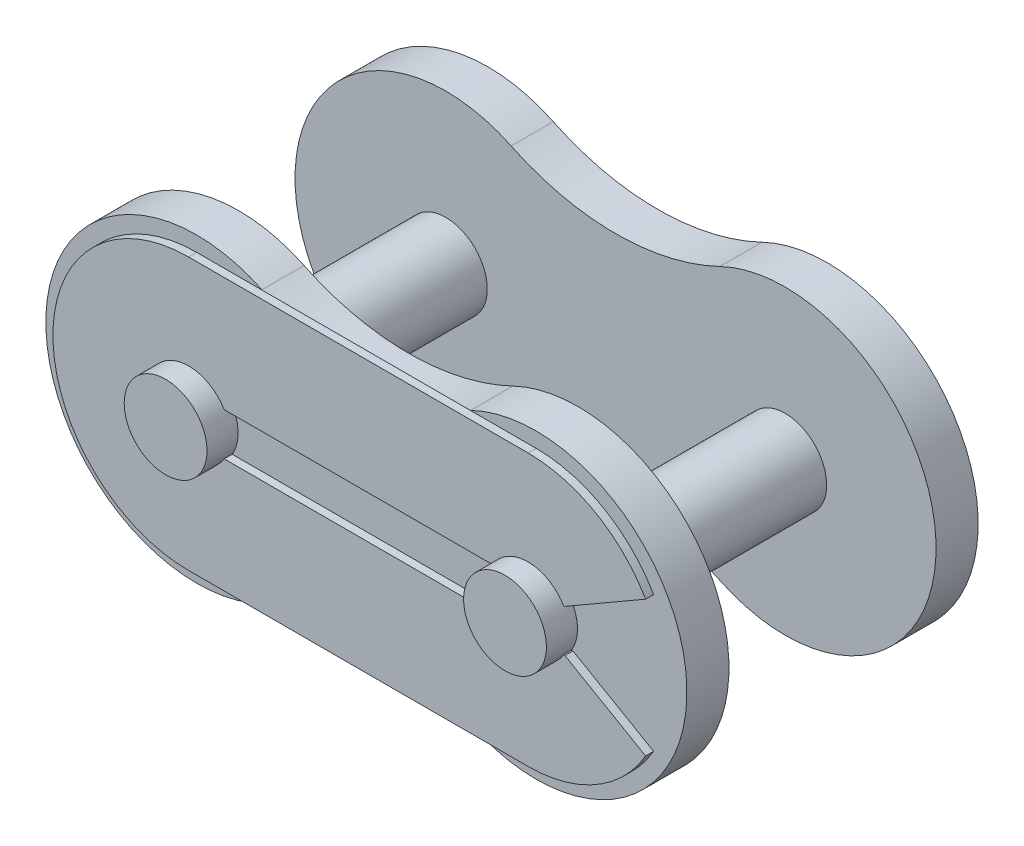
ISO-10303-21;
HEADER;
FILE_DESCRIPTION(('STEP AP214'),'2;1');
FILE_NAME('part.step','',(''),(''),'','','');
FILE_SCHEMA(('AUTOMOTIVE_DESIGN { 1 0 10303 214 1 1 1 1 }'));
ENDSEC;
DATA;
#1=APPLICATION_CONTEXT('core data for automotive mechanical design processes');
#2=APPLICATION_PROTOCOL_DEFINITION('international standard','automotive_design',2000,#1);
#3=PRODUCT_CONTEXT('',#1,'mechanical');
#4=PRODUCT('Part','Part','',(#3));
#5=PRODUCT_RELATED_PRODUCT_CATEGORY('part','',(#4));
#6=PRODUCT_DEFINITION_FORMATION('','',#4);
#7=PRODUCT_DEFINITION_CONTEXT('part definition',#1,'design');
#8=PRODUCT_DEFINITION('design','',#6,#7);
#9=PRODUCT_DEFINITION_SHAPE('','',#8);
#10=(LENGTH_UNIT() NAMED_UNIT(*) SI_UNIT(.MILLI.,.METRE.));
#11=(NAMED_UNIT(*) PLANE_ANGLE_UNIT() SI_UNIT($,.RADIAN.));
#12=(NAMED_UNIT(*) SI_UNIT($,.STERADIAN.) SOLID_ANGLE_UNIT());
#13=UNCERTAINTY_MEASURE_WITH_UNIT(LENGTH_MEASURE(1.E-05),#10,'distance_accuracy_value','');
#14=(GEOMETRIC_REPRESENTATION_CONTEXT(3) GLOBAL_UNCERTAINTY_ASSIGNED_CONTEXT((#13)) GLOBAL_UNIT_ASSIGNED_CONTEXT((#10,
#11,#12)) REPRESENTATION_CONTEXT('',''));
#15=CARTESIAN_POINT('',(0.,0.,0.));
#16=DIRECTION('',(0.,0.,1.));
#17=DIRECTION('',(1.,0.,0.));
#18=AXIS2_PLACEMENT_3D('',#15,#16,#17);
#19=CARTESIAN_POINT('',(0.,0.,6.6125));
#20=DIRECTION('',(0.,0.,1.));
#21=DIRECTION('',(1.,0.,0.));
#22=AXIS2_PLACEMENT_3D('',#19,#20,#21);
#23=PLANE('',#22);
#24=CARTESIAN_POINT('',(12.7,0.,6.6125));
#25=DIRECTION('',(0.,0.,-1.));
#26=DIRECTION('',(-1.,0.,0.));
#27=AXIS2_PLACEMENT_3D('',#24,#25,#26);
#28=CIRCLE('',#27,1.55);
#29=CARTESIAN_POINT('',(11.15,0.,6.6125));
#30=VERTEX_POINT('',#29);
#31=EDGE_CURVE('E19',#30,#30,#28,.T.);
#32=ORIENTED_EDGE('',*,*,#31,.F.);
#33=EDGE_LOOP('',(#32));
#34=FACE_BOUND('',#33,.T.);
#35=ADVANCED_FACE('F15',(#34),#23,.T.);
#36=CARTESIAN_POINT('',(0.,0.,6.6125));
#37=DIRECTION('',(0.,0.,1.));
#38=DIRECTION('',(1.,0.,0.));
#39=AXIS2_PLACEMENT_3D('',#36,#37,#38);
#40=PLANE('',#39);
#41=CARTESIAN_POINT('',(0.,0.,6.6125));
#42=DIRECTION('',(0.,0.,-1.));
#43=DIRECTION('',(-1.,0.,0.));
#44=AXIS2_PLACEMENT_3D('',#41,#42,#43);
#45=CIRCLE('',#44,1.55);
#46=CARTESIAN_POINT('',(-1.55,0.,6.6125));
#47=VERTEX_POINT('',#46);
#48=EDGE_CURVE('E189',#47,#47,#45,.T.);
#49=ORIENTED_EDGE('',*,*,#48,.F.);
#50=EDGE_LOOP('',(#49));
#51=FACE_BOUND('',#50,.T.);
#52=ADVANCED_FACE('F804',(#51),#40,.T.);
#53=CARTESIAN_POINT('',(0.,0.,5.45));
#54=DIRECTION('',(0.,0.,1.));
#55=DIRECTION('',(1.,0.,0.));
#56=AXIS2_PLACEMENT_3D('',#53,#54,#55);
#57=PLANE('',#56);
#58=CARTESIAN_POINT('',(12.7,0.,5.45));
#59=DIRECTION('',(0.,0.,-1.));
#60=DIRECTION('',(-1.,0.,0.));
#61=AXIS2_PLACEMENT_3D('',#58,#59,#60);
#62=CIRCLE('',#61,1.55);
#63=CARTESIAN_POINT('',(11.3710549531677,0.79775,5.45));
#64=VERTEX_POINT('',#63);
#65=CARTESIAN_POINT('',(11.3710549531677,-0.79775,5.45));
#66=VERTEX_POINT('',#65);
#67=EDGE_CURVE('E168',#64,#66,#62,.F.);
#68=ORIENTED_EDGE('',*,*,#67,.F.);
#69=DIRECTION('',(1.,0.,0.));
#70=VECTOR('',#69,1.);
#71=CARTESIAN_POINT('',(14.0817435317381,0.79775,5.45));
#72=LINE('',#71,#70);
#73=CARTESIAN_POINT('',(1.32894504683226,0.79775,5.45));
#74=VERTEX_POINT('',#73);
#75=EDGE_CURVE('E172',#74,#64,#72,.T.);
#76=ORIENTED_EDGE('',*,*,#75,.F.);
#77=CARTESIAN_POINT('',(0.,0.,5.45));
#78=DIRECTION('',(0.,0.,-1.));
#79=DIRECTION('',(-1.,0.,0.));
#80=AXIS2_PLACEMENT_3D('',#77,#78,#79);
#81=CIRCLE('',#80,1.55);
#82=CARTESIAN_POINT('',(1.32894504683226,-0.79775,5.45));
#83=VERTEX_POINT('',#82);
#84=EDGE_CURVE('E320',#83,#74,#81,.F.);
#85=ORIENTED_EDGE('',*,*,#84,.F.);
#86=DIRECTION('',(1.,0.,0.));
#87=VECTOR('',#86,1.);
#88=CARTESIAN_POINT('',(0.,-0.79775,5.45));
#89=LINE('',#88,#87);
#90=EDGE_CURVE('E175',#66,#83,#89,.F.);
#91=ORIENTED_EDGE('',*,*,#90,.F.);
#92=EDGE_LOOP('',(#68,#76,#85,#91));
#93=FACE_BOUND('',#92,.T.);
#94=ADVANCED_FACE('F170',(#93),#57,.T.);
#95=CARTESIAN_POINT('',(12.7,0.,6.6125));
#96=DIRECTION('',(0.,0.,-1.));
#97=DIRECTION('',(-1.,0.,0.));
#98=AXIS2_PLACEMENT_3D('',#95,#96,#97);
#99=CYLINDRICAL_SURFACE('',#98,1.55);
#100=ORIENTED_EDGE('',*,*,#31,.T.);
#101=EDGE_LOOP('',(#100));
#102=FACE_BOUND('',#101,.T.);
#103=DIRECTION('',(0.,0.,-1.));
#104=VECTOR('',#103,1.);
#105=CARTESIAN_POINT('',(14.0289450468323,-0.797749999999981,6.6125));
#106=LINE('',#105,#104);
#107=CARTESIAN_POINT('',(14.0289450468323,-0.797749999999991,5.75));
#108=VERTEX_POINT('',#107);
#109=CARTESIAN_POINT('',(14.0289450468323,-0.797749999999991,5.45));
#110=VERTEX_POINT('',#109);
#111=EDGE_CURVE('E178',#108,#110,#106,.T.);
#112=ORIENTED_EDGE('',*,*,#111,.T.);
#113=CARTESIAN_POINT('',(12.7,0.,5.45));
#114=DIRECTION('',(0.,0.,-1.));
#115=DIRECTION('',(-1.,0.,0.));
#116=AXIS2_PLACEMENT_3D('',#113,#114,#115);
#117=CIRCLE('',#116,1.55);
#118=CARTESIAN_POINT('',(14.0289450468323,0.797749999999991,5.45));
#119=VERTEX_POINT('',#118);
#120=EDGE_CURVE('E322',#110,#119,#117,.F.);
#121=ORIENTED_EDGE('',*,*,#120,.T.);
#122=DIRECTION('',(0.,0.,-1.));
#123=VECTOR('',#122,1.);
#124=CARTESIAN_POINT('',(14.0289450468323,0.797749999999982,6.6125));
#125=LINE('',#124,#123);
#126=CARTESIAN_POINT('',(14.0289450468323,0.797749999999991,5.75));
#127=VERTEX_POINT('',#126);
#128=EDGE_CURVE('E198',#119,#127,#125,.F.);
#129=ORIENTED_EDGE('',*,*,#128,.T.);
#130=CARTESIAN_POINT('',(12.7,0.,5.75));
#131=DIRECTION('',(0.,0.,-1.));
#132=DIRECTION('',(-1.,0.,0.));
#133=AXIS2_PLACEMENT_3D('',#130,#131,#132);
#134=CIRCLE('',#133,1.55);
#135=CARTESIAN_POINT('',(11.3710549531677,0.79775,5.75));
#136=VERTEX_POINT('',#135);
#137=EDGE_CURVE('E184',#136,#127,#134,.T.);
#138=ORIENTED_EDGE('',*,*,#137,.F.);
#139=DIRECTION('',(0.,0.,-1.));
#140=VECTOR('',#139,1.);
#141=CARTESIAN_POINT('',(11.3710549531677,0.79775,5.45));
#142=LINE('',#141,#140);
#143=EDGE_CURVE('E180',#64,#136,#142,.F.);
#144=ORIENTED_EDGE('',*,*,#143,.F.);
#145=ORIENTED_EDGE('',*,*,#67,.T.);
#146=DIRECTION('',(0.,0.,1.));
#147=VECTOR('',#146,1.);
#148=CARTESIAN_POINT('',(11.3710549531677,-0.79775,5.45));
#149=LINE('',#148,#147);
#150=CARTESIAN_POINT('',(11.3710549531677,-0.79775,5.75));
#151=VERTEX_POINT('',#150);
#152=EDGE_CURVE('E201',#151,#66,#149,.F.);
#153=ORIENTED_EDGE('',*,*,#152,.F.);
#154=CARTESIAN_POINT('',(12.7,0.,5.75));
#155=DIRECTION('',(0.,0.,-1.));
#156=DIRECTION('',(-1.,0.,0.));
#157=AXIS2_PLACEMENT_3D('',#154,#155,#156);
#158=CIRCLE('',#157,1.55);
#159=EDGE_CURVE('E193',#108,#151,#158,.T.);
#160=ORIENTED_EDGE('',*,*,#159,.F.);
#161=EDGE_LOOP('',(#112,#121,#129,#138,#144,#145,#153,#160));
#162=FACE_BOUND('',#161,.T.);
#163=ADVANCED_FACE('F182',(#102,#162),#99,.T.);
#164=CARTESIAN_POINT('',(0.,-0.79775,5.45));
#165=DIRECTION('',(0.,1.,0.));
#166=DIRECTION('',(0.,0.,1.));
#167=AXIS2_PLACEMENT_3D('',#164,#165,#166);
#168=PLANE('',#167);
#169=ORIENTED_EDGE('',*,*,#152,.T.);
#170=ORIENTED_EDGE('',*,*,#90,.T.);
#171=DIRECTION('',(0.,0.,-1.));
#172=VECTOR('',#171,1.);
#173=CARTESIAN_POINT('',(1.32894504683226,-0.79775,6.6125));
#174=LINE('',#173,#172);
#175=CARTESIAN_POINT('',(1.32894504683226,-0.79775,5.75));
#176=VERTEX_POINT('',#175);
#177=EDGE_CURVE('E200',#176,#83,#174,.T.);
#178=ORIENTED_EDGE('',*,*,#177,.F.);
#179=DIRECTION('',(1.,0.,0.));
#180=VECTOR('',#179,1.);
#181=CARTESIAN_POINT('',(0.,-0.79775,5.75));
#182=LINE('',#181,#180);
#183=EDGE_CURVE('E315',#151,#176,#182,.F.);
#184=ORIENTED_EDGE('',*,*,#183,.F.);
#185=EDGE_LOOP('',(#169,#170,#178,#184));
#186=FACE_BOUND('',#185,.T.);
#187=ADVANCED_FACE('F434',(#186),#168,.T.);
#188=CARTESIAN_POINT('',(0.,0.,6.6125));
#189=DIRECTION('',(0.,0.,-1.));
#190=DIRECTION('',(-1.,0.,0.));
#191=AXIS2_PLACEMENT_3D('',#188,#189,#190);
#192=CYLINDRICAL_SURFACE('',#191,1.55);
#193=ORIENTED_EDGE('',*,*,#177,.T.);
#194=ORIENTED_EDGE('',*,*,#84,.T.);
#195=DIRECTION('',(0.,0.,-1.));
#196=VECTOR('',#195,1.);
#197=CARTESIAN_POINT('',(1.32894504683226,0.79775,5.45));
#198=LINE('',#197,#196);
#199=CARTESIAN_POINT('',(1.32894504683226,0.79775,5.75));
#200=VERTEX_POINT('',#199);
#201=EDGE_CURVE('E188',#200,#74,#198,.T.);
#202=ORIENTED_EDGE('',*,*,#201,.F.);
#203=CARTESIAN_POINT('',(0.,0.,5.75));
#204=DIRECTION('',(0.,0.,-1.));
#205=DIRECTION('',(-1.,0.,0.));
#206=AXIS2_PLACEMENT_3D('',#203,#204,#205);
#207=CIRCLE('',#206,1.55);
#208=EDGE_CURVE('E311',#176,#200,#207,.T.);
#209=ORIENTED_EDGE('',*,*,#208,.F.);
#210=EDGE_LOOP('',(#193,#194,#202,#209));
#211=FACE_BOUND('',#210,.T.);
#212=ORIENTED_EDGE('',*,*,#48,.T.);
#213=EDGE_LOOP('',(#212));
#214=FACE_BOUND('',#213,.T.);
#215=ADVANCED_FACE('F431',(#211,#214),#192,.T.);
#216=CARTESIAN_POINT('',(14.0817435317381,0.79775,5.45));
#217=DIRECTION('',(0.,-1.,0.));
#218=DIRECTION('',(0.,0.,-1.));
#219=AXIS2_PLACEMENT_3D('',#216,#217,#218);
#220=PLANE('',#219);
#221=ORIENTED_EDGE('',*,*,#201,.T.);
#222=ORIENTED_EDGE('',*,*,#75,.T.);
#223=ORIENTED_EDGE('',*,*,#143,.T.);
#224=DIRECTION('',(1.,0.,0.));
#225=VECTOR('',#224,1.);
#226=CARTESIAN_POINT('',(0.,0.79775,5.75));
#227=LINE('',#226,#225);
#228=EDGE_CURVE('E314',#200,#136,#227,.T.);
#229=ORIENTED_EDGE('',*,*,#228,.F.);
#230=EDGE_LOOP('',(#221,#222,#223,#229));
#231=FACE_BOUND('',#230,.T.);
#232=ADVANCED_FACE('F191',(#231),#220,.T.);
#233=CARTESIAN_POINT('',(0.,0.,5.75));
#234=DIRECTION('',(0.,0.,1.));
#235=DIRECTION('',(1.,0.,0.));
#236=AXIS2_PLACEMENT_3D('',#233,#234,#235);
#237=PLANE('',#236);
#238=ORIENTED_EDGE('',*,*,#208,.T.);
#239=ORIENTED_EDGE('',*,*,#228,.T.);
#240=ORIENTED_EDGE('',*,*,#137,.T.);
#241=DIRECTION('',(1.,0.,0.));
#242=VECTOR('',#241,1.);
#243=CARTESIAN_POINT('',(14.0817435317381,0.79775,5.75));
#244=LINE('',#243,#242);
#245=CARTESIAN_POINT('',(14.0817435317381,0.797750000000007,5.75));
#246=VERTEX_POINT('',#245);
#247=EDGE_CURVE('E336',#246,#127,#244,.F.);
#248=ORIENTED_EDGE('',*,*,#247,.F.);
#249=DIRECTION('',(0.866025403784438,0.500000000000001,0.));
#250=VECTOR('',#249,1.);
#251=CARTESIAN_POINT('',(17.0994523524951,2.54002499999998,5.75));
#252=LINE('',#251,#250);
#253=CARTESIAN_POINT('',(17.0994523524951,2.54002499999999,5.75));
#254=VERTEX_POINT('',#253);
#255=EDGE_CURVE('E305',#254,#246,#252,.F.);
#256=ORIENTED_EDGE('',*,*,#255,.F.);
#257=CARTESIAN_POINT('',(12.7,0.,5.75));
#258=DIRECTION('',(0.,0.,1.));
#259=DIRECTION('',(1.,0.,0.));
#260=AXIS2_PLACEMENT_3D('',#257,#258,#259);
#261=CIRCLE('',#260,5.08005);
#262=CARTESIAN_POINT('',(12.7,5.08005,5.75));
#263=VERTEX_POINT('',#262);
#264=EDGE_CURVE('E302',#263,#254,#261,.F.);
#265=ORIENTED_EDGE('',*,*,#264,.F.);
#266=DIRECTION('',(1.,0.,0.));
#267=VECTOR('',#266,1.);
#268=CARTESIAN_POINT('',(0.,5.08005,5.75));
#269=LINE('',#268,#267);
#270=CARTESIAN_POINT('',(0.,5.08005,5.75));
#271=VERTEX_POINT('',#270);
#272=EDGE_CURVE('E350',#271,#263,#269,.T.);
#273=ORIENTED_EDGE('',*,*,#272,.F.);
#274=CARTESIAN_POINT('',(0.,0.,5.75));
#275=DIRECTION('',(0.,0.,1.));
#276=DIRECTION('',(1.,0.,0.));
#277=AXIS2_PLACEMENT_3D('',#274,#275,#276);
#278=CIRCLE('',#277,5.08005);
#279=CARTESIAN_POINT('',(0.,-5.08005,5.75));
#280=VERTEX_POINT('',#279);
#281=EDGE_CURVE('E297',#280,#271,#278,.F.);
#282=ORIENTED_EDGE('',*,*,#281,.F.);
#283=DIRECTION('',(1.,0.,0.));
#284=VECTOR('',#283,1.);
#285=CARTESIAN_POINT('',(12.7,-5.08005,5.75));
#286=LINE('',#285,#284);
#287=CARTESIAN_POINT('',(12.7,-5.08005,5.75));
#288=VERTEX_POINT('',#287);
#289=EDGE_CURVE('E355',#288,#280,#286,.F.);
#290=ORIENTED_EDGE('',*,*,#289,.F.);
#291=CARTESIAN_POINT('',(12.7,0.,5.75));
#292=DIRECTION('',(0.,0.,1.));
#293=DIRECTION('',(1.,0.,0.));
#294=AXIS2_PLACEMENT_3D('',#291,#292,#293);
#295=CIRCLE('',#294,5.08005);
#296=CARTESIAN_POINT('',(17.0994523524951,-2.540025,5.75));
#297=VERTEX_POINT('',#296);
#298=EDGE_CURVE('E307',#297,#288,#295,.F.);
#299=ORIENTED_EDGE('',*,*,#298,.F.);
#300=DIRECTION('',(-0.866025403784439,0.5,0.));
#301=VECTOR('',#300,1.);
#302=CARTESIAN_POINT('',(14.0817435317381,-0.79775,5.75));
#303=LINE('',#302,#301);
#304=CARTESIAN_POINT('',(14.0817435317381,-0.79775,5.75));
#305=VERTEX_POINT('',#304);
#306=EDGE_CURVE('E335',#305,#297,#303,.F.);
#307=ORIENTED_EDGE('',*,*,#306,.F.);
#308=DIRECTION('',(1.,0.,0.));
#309=VECTOR('',#308,1.);
#310=CARTESIAN_POINT('',(0.,-0.79775,5.75));
#311=LINE('',#310,#309);
#312=EDGE_CURVE('E332',#108,#305,#311,.T.);
#313=ORIENTED_EDGE('',*,*,#312,.F.);
#314=ORIENTED_EDGE('',*,*,#159,.T.);
#315=ORIENTED_EDGE('',*,*,#183,.T.);
#316=EDGE_LOOP('',(#238,#239,#240,#248,#256,#265,#273,#282,#290,#299,#307,#313,#314,#315));
#317=FACE_BOUND('',#316,.T.);
#318=ADVANCED_FACE('F426',(#317),#237,.T.);
#319=CARTESIAN_POINT('',(14.0817435317381,0.79775,5.45));
#320=DIRECTION('',(0.,-1.,0.));
#321=DIRECTION('',(0.,0.,-1.));
#322=AXIS2_PLACEMENT_3D('',#319,#320,#321);
#323=PLANE('',#322);
#324=DIRECTION('',(0.,0.,1.));
#325=VECTOR('',#324,1.);
#326=CARTESIAN_POINT('',(14.0817435317381,0.797750000000011,5.45));
#327=LINE('',#326,#325);
#328=CARTESIAN_POINT('',(14.0817435317381,0.797750000000004,5.45));
#329=VERTEX_POINT('',#328);
#330=EDGE_CURVE('E349',#246,#329,#327,.F.);
#331=ORIENTED_EDGE('',*,*,#330,.F.);
#332=ORIENTED_EDGE('',*,*,#247,.T.);
#333=ORIENTED_EDGE('',*,*,#128,.F.);
#334=DIRECTION('',(1.,0.,0.));
#335=VECTOR('',#334,1.);
#336=CARTESIAN_POINT('',(0.,0.79775,5.45));
#337=LINE('',#336,#335);
#338=EDGE_CURVE('E402',#329,#119,#337,.F.);
#339=ORIENTED_EDGE('',*,*,#338,.F.);
#340=EDGE_LOOP('',(#331,#332,#333,#339));
#341=FACE_BOUND('',#340,.T.);
#342=ADVANCED_FACE('F452',(#341),#323,.T.);
#343=CARTESIAN_POINT('',(0.,-0.79775,5.45));
#344=DIRECTION('',(0.,1.,0.));
#345=DIRECTION('',(0.,0.,1.));
#346=AXIS2_PLACEMENT_3D('',#343,#344,#345);
#347=PLANE('',#346);
#348=DIRECTION('',(0.,0.,1.));
#349=VECTOR('',#348,1.);
#350=CARTESIAN_POINT('',(14.0817435317381,-0.79775,5.45));
#351=LINE('',#350,#349);
#352=CARTESIAN_POINT('',(14.0817435317381,-0.797750000000002,5.45));
#353=VERTEX_POINT('',#352);
#354=EDGE_CURVE('E310',#353,#305,#351,.T.);
#355=ORIENTED_EDGE('',*,*,#354,.F.);
#356=DIRECTION('',(1.,0.,0.));
#357=VECTOR('',#356,1.);
#358=CARTESIAN_POINT('',(0.,-0.79775,5.45));
#359=LINE('',#358,#357);
#360=EDGE_CURVE('E405',#110,#353,#359,.T.);
#361=ORIENTED_EDGE('',*,*,#360,.F.);
#362=ORIENTED_EDGE('',*,*,#111,.F.);
#363=ORIENTED_EDGE('',*,*,#312,.T.);
#364=EDGE_LOOP('',(#355,#361,#362,#363));
#365=FACE_BOUND('',#364,.T.);
#366=ADVANCED_FACE('F439',(#365),#347,.T.);
#367=CARTESIAN_POINT('',(14.0817435317381,-0.79775,5.45));
#368=DIRECTION('',(0.5,0.866025403784439,0.));
#369=DIRECTION('',(-0.866025403784439,0.5,0.));
#370=AXIS2_PLACEMENT_3D('',#367,#368,#369);
#371=PLANE('',#370);
#372=DIRECTION('',(0.866025403784435,-0.500000000000006,0.));
#373=VECTOR('',#372,1.);
#374=CARTESIAN_POINT('',(14.0817435317381,-0.79775,5.45));
#375=LINE('',#374,#373);
#376=CARTESIAN_POINT('',(17.0994523524951,-2.54002500000001,5.45));
#377=VERTEX_POINT('',#376);
#378=EDGE_CURVE('E296',#353,#377,#375,.T.);
#379=ORIENTED_EDGE('',*,*,#378,.F.);
#380=ORIENTED_EDGE('',*,*,#354,.T.);
#381=ORIENTED_EDGE('',*,*,#306,.T.);
#382=DIRECTION('',(0.,0.,1.));
#383=VECTOR('',#382,1.);
#384=CARTESIAN_POINT('',(17.0994523524951,-2.54002500000001,5.45));
#385=LINE('',#384,#383);
#386=EDGE_CURVE('E306',#377,#297,#385,.T.);
#387=ORIENTED_EDGE('',*,*,#386,.F.);
#388=EDGE_LOOP('',(#379,#380,#381,#387));
#389=FACE_BOUND('',#388,.T.);
#390=ADVANCED_FACE('F443',(#389),#371,.T.);
#391=CARTESIAN_POINT('',(12.7,0.,5.45));
#392=DIRECTION('',(0.,0.,1.));
#393=DIRECTION('',(1.,0.,0.));
#394=AXIS2_PLACEMENT_3D('',#391,#392,#393);
#395=CYLINDRICAL_SURFACE('',#394,5.08005);
#396=CARTESIAN_POINT('',(12.7,0.,5.45));
#397=DIRECTION('',(0.,0.,1.));
#398=DIRECTION('',(1.,0.,0.));
#399=AXIS2_PLACEMENT_3D('',#396,#397,#398);
#400=CIRCLE('',#399,5.08005);
#401=CARTESIAN_POINT('',(12.7,-5.08005,5.45));
#402=VERTEX_POINT('',#401);
#403=EDGE_CURVE('E293',#377,#402,#400,.F.);
#404=ORIENTED_EDGE('',*,*,#403,.F.);
#405=ORIENTED_EDGE('',*,*,#386,.T.);
#406=ORIENTED_EDGE('',*,*,#298,.T.);
#407=DIRECTION('',(0.,0.,-1.));
#408=VECTOR('',#407,1.);
#409=CARTESIAN_POINT('',(12.7,-5.08005,5.45));
#410=LINE('',#409,#408);
#411=EDGE_CURVE('E301',#402,#288,#410,.F.);
#412=ORIENTED_EDGE('',*,*,#411,.F.);
#413=EDGE_LOOP('',(#404,#405,#406,#412));
#414=FACE_BOUND('',#413,.T.);
#415=ADVANCED_FACE('F731',(#414),#395,.T.);
#416=CARTESIAN_POINT('',(12.7,0.,5.45));
#417=DIRECTION('',(0.,0.,1.));
#418=DIRECTION('',(1.,0.,0.));
#419=AXIS2_PLACEMENT_3D('',#416,#417,#418);
#420=CYLINDRICAL_SURFACE('',#419,5.08005);
#421=CARTESIAN_POINT('',(12.7,0.,5.45));
#422=DIRECTION('',(0.,0.,1.));
#423=DIRECTION('',(1.,0.,0.));
#424=AXIS2_PLACEMENT_3D('',#421,#422,#423);
#425=CIRCLE('',#424,5.08005);
#426=CARTESIAN_POINT('',(12.7,5.08005,5.45));
#427=VERTEX_POINT('',#426);
#428=CARTESIAN_POINT('',(17.0994523524951,2.54002499999999,5.45));
#429=VERTEX_POINT('',#428);
#430=EDGE_CURVE('E284',#427,#429,#425,.F.);
#431=ORIENTED_EDGE('',*,*,#430,.F.);
#432=DIRECTION('',(0.,0.,1.));
#433=VECTOR('',#432,1.);
#434=CARTESIAN_POINT('',(12.7,5.08005,5.45));
#435=LINE('',#434,#433);
#436=EDGE_CURVE('E353',#263,#427,#435,.F.);
#437=ORIENTED_EDGE('',*,*,#436,.F.);
#438=ORIENTED_EDGE('',*,*,#264,.T.);
#439=DIRECTION('',(0.,0.,1.));
#440=VECTOR('',#439,1.);
#441=CARTESIAN_POINT('',(17.0994523524951,2.54002499999998,5.45));
#442=LINE('',#441,#440);
#443=EDGE_CURVE('E354',#429,#254,#442,.T.);
#444=ORIENTED_EDGE('',*,*,#443,.F.);
#445=EDGE_LOOP('',(#431,#437,#438,#444));
#446=FACE_BOUND('',#445,.T.);
#447=ADVANCED_FACE('F459',(#446),#420,.T.);
#448=CARTESIAN_POINT('',(17.0994523524951,2.54002499999998,5.45));
#449=DIRECTION('',(0.500000000000001,-0.866025403784438,0.));
#450=DIRECTION('',(0.866025403784438,0.500000000000001,0.));
#451=AXIS2_PLACEMENT_3D('',#448,#449,#450);
#452=PLANE('',#451);
#453=DIRECTION('',(-0.866025403784436,-0.500000000000004,0.));
#454=VECTOR('',#453,1.);
#455=CARTESIAN_POINT('',(17.0994523524951,2.54002499999998,5.45));
#456=LINE('',#455,#454);
#457=EDGE_CURVE('E287',#429,#329,#456,.T.);
#458=ORIENTED_EDGE('',*,*,#457,.F.);
#459=ORIENTED_EDGE('',*,*,#443,.T.);
#460=ORIENTED_EDGE('',*,*,#255,.T.);
#461=ORIENTED_EDGE('',*,*,#330,.T.);
#462=EDGE_LOOP('',(#458,#459,#460,#461));
#463=FACE_BOUND('',#462,.T.);
#464=ADVANCED_FACE('F455',(#463),#452,.T.);
#465=CARTESIAN_POINT('',(0.,5.08005,5.45));
#466=DIRECTION('',(0.,1.,0.));
#467=DIRECTION('',(0.,0.,1.));
#468=AXIS2_PLACEMENT_3D('',#465,#466,#467);
#469=PLANE('',#468);
#470=DIRECTION('',(1.,0.,0.));
#471=VECTOR('',#470,1.);
#472=CARTESIAN_POINT('',(0.,5.08005,5.45));
#473=LINE('',#472,#471);
#474=CARTESIAN_POINT('',(0.,5.08005,5.45));
#475=VERTEX_POINT('',#474);
#476=CARTESIAN_POINT('',(2.4605150527117,5.08005000000001,5.45));
#477=VERTEX_POINT('',#476);
#478=EDGE_CURVE('E393',#475,#477,#473,.T.);
#479=ORIENTED_EDGE('',*,*,#478,.F.);
#480=DIRECTION('',(0.,0.,1.));
#481=VECTOR('',#480,1.);
#482=CARTESIAN_POINT('',(0.,5.08005,5.45));
#483=LINE('',#482,#481);
#484=EDGE_CURVE('E300',#271,#475,#483,.F.);
#485=ORIENTED_EDGE('',*,*,#484,.F.);
#486=ORIENTED_EDGE('',*,*,#272,.T.);
#487=ORIENTED_EDGE('',*,*,#436,.T.);
#488=DIRECTION('',(1.,0.,0.));
#489=VECTOR('',#488,1.);
#490=CARTESIAN_POINT('',(0.,5.08005,5.45));
#491=LINE('',#490,#489);
#492=CARTESIAN_POINT('',(10.2394849472884,5.08005,5.45));
#493=VERTEX_POINT('',#492);
#494=EDGE_CURVE('E288',#493,#427,#491,.T.);
#495=ORIENTED_EDGE('',*,*,#494,.F.);
#496=DIRECTION('',(1.,0.,0.));
#497=VECTOR('',#496,1.);
#498=CARTESIAN_POINT('',(0.,5.08005,5.45));
#499=LINE('',#498,#497);
#500=EDGE_CURVE('E396',#493,#477,#499,.F.);
#501=ORIENTED_EDGE('',*,*,#500,.T.);
#502=EDGE_LOOP('',(#479,#485,#486,#487,#495,#501));
#503=FACE_BOUND('',#502,.T.);
#504=ADVANCED_FACE('F462',(#503),#469,.T.);
#505=CARTESIAN_POINT('',(12.7,-5.08005,5.45));
#506=DIRECTION('',(0.,-1.,0.));
#507=DIRECTION('',(0.,0.,-1.));
#508=AXIS2_PLACEMENT_3D('',#505,#506,#507);
#509=PLANE('',#508);
#510=DIRECTION('',(1.,0.,0.));
#511=VECTOR('',#510,1.);
#512=CARTESIAN_POINT('',(0.,-5.08005,5.45));
#513=LINE('',#512,#511);
#514=CARTESIAN_POINT('',(10.2394849472883,-5.08005,5.45));
#515=VERTEX_POINT('',#514);
#516=EDGE_CURVE('E292',#402,#515,#513,.F.);
#517=ORIENTED_EDGE('',*,*,#516,.F.);
#518=ORIENTED_EDGE('',*,*,#411,.T.);
#519=ORIENTED_EDGE('',*,*,#289,.T.);
#520=DIRECTION('',(0.,0.,1.));
#521=VECTOR('',#520,1.);
#522=CARTESIAN_POINT('',(0.,-5.08005,5.45));
#523=LINE('',#522,#521);
#524=CARTESIAN_POINT('',(0.,-5.08005,5.45));
#525=VERTEX_POINT('',#524);
#526=EDGE_CURVE('E373',#525,#280,#523,.T.);
#527=ORIENTED_EDGE('',*,*,#526,.F.);
#528=DIRECTION('',(1.,0.,0.));
#529=VECTOR('',#528,1.);
#530=CARTESIAN_POINT('',(0.,-5.08005,5.45));
#531=LINE('',#530,#529);
#532=CARTESIAN_POINT('',(2.46051505271168,-5.08005,5.45));
#533=VERTEX_POINT('',#532);
#534=EDGE_CURVE('E283',#533,#525,#531,.F.);
#535=ORIENTED_EDGE('',*,*,#534,.F.);
#536=DIRECTION('',(1.,0.,0.));
#537=VECTOR('',#536,1.);
#538=CARTESIAN_POINT('',(0.,-5.08005,5.45));
#539=LINE('',#538,#537);
#540=EDGE_CURVE('E376',#533,#515,#539,.T.);
#541=ORIENTED_EDGE('',*,*,#540,.T.);
#542=EDGE_LOOP('',(#517,#518,#519,#527,#535,#541));
#543=FACE_BOUND('',#542,.T.);
#544=ADVANCED_FACE('F466',(#543),#509,.T.);
#545=CARTESIAN_POINT('',(0.,0.,5.45));
#546=DIRECTION('',(0.,0.,1.));
#547=DIRECTION('',(1.,0.,0.));
#548=AXIS2_PLACEMENT_3D('',#545,#546,#547);
#549=CYLINDRICAL_SURFACE('',#548,5.08005);
#550=CARTESIAN_POINT('',(0.,0.,5.45));
#551=DIRECTION('',(0.,0.,1.));
#552=DIRECTION('',(1.,0.,0.));
#553=AXIS2_PLACEMENT_3D('',#550,#551,#552);
#554=CIRCLE('',#553,5.08005);
#555=EDGE_CURVE('E280',#525,#475,#554,.F.);
#556=ORIENTED_EDGE('',*,*,#555,.F.);
#557=ORIENTED_EDGE('',*,*,#526,.T.);
#558=ORIENTED_EDGE('',*,*,#281,.T.);
#559=ORIENTED_EDGE('',*,*,#484,.T.);
#560=EDGE_LOOP('',(#556,#557,#558,#559));
#561=FACE_BOUND('',#560,.T.);
#562=ADVANCED_FACE('F468',(#561),#549,.T.);
#563=CARTESIAN_POINT('',(0.,0.,-6.6125));
#564=DIRECTION('',(0.,0.,1.));
#565=DIRECTION('',(1.,0.,0.));
#566=AXIS2_PLACEMENT_3D('',#563,#564,#565);
#567=PLANE('',#566);
#568=CARTESIAN_POINT('',(12.7,0.,-6.6125));
#569=DIRECTION('',(0.,0.,-1.));
#570=DIRECTION('',(-1.,0.,0.));
#571=AXIS2_PLACEMENT_3D('',#568,#569,#570);
#572=CIRCLE('',#571,1.55);
#573=CARTESIAN_POINT('',(11.15,0.,-6.6125));
#574=VERTEX_POINT('',#573);
#575=EDGE_CURVE('E277',#574,#574,#572,.F.);
#576=ORIENTED_EDGE('',*,*,#575,.F.);
#577=EDGE_LOOP('',(#576));
#578=FACE_BOUND('',#577,.T.);
#579=ADVANCED_FACE('F686',(#578),#567,.F.);
#580=CARTESIAN_POINT('',(0.,0.,-6.6125));
#581=DIRECTION('',(0.,0.,1.));
#582=DIRECTION('',(1.,0.,0.));
#583=AXIS2_PLACEMENT_3D('',#580,#581,#582);
#584=PLANE('',#583);
#585=CARTESIAN_POINT('',(0.,0.,-6.6125));
#586=DIRECTION('',(0.,0.,-1.));
#587=DIRECTION('',(-1.,0.,0.));
#588=AXIS2_PLACEMENT_3D('',#585,#586,#587);
#589=CIRCLE('',#588,1.55);
#590=CARTESIAN_POINT('',(-1.55,0.,-6.6125));
#591=VERTEX_POINT('',#590);
#592=EDGE_CURVE('E274',#591,#591,#589,.F.);
#593=ORIENTED_EDGE('',*,*,#592,.F.);
#594=EDGE_LOOP('',(#593));
#595=FACE_BOUND('',#594,.T.);
#596=ADVANCED_FACE('F678',(#595),#584,.F.);
#597=CARTESIAN_POINT('',(0.,0.,5.45));
#598=DIRECTION('',(0.,0.,1.));
#599=DIRECTION('',(1.,0.,0.));
#600=AXIS2_PLACEMENT_3D('',#597,#598,#599);
#601=PLANE('',#600);
#602=ORIENTED_EDGE('',*,*,#540,.F.);
#603=CARTESIAN_POINT('',(6.35,-13.2307849536602,5.45));
#604=DIRECTION('',(0.,0.,1.));
#605=DIRECTION('',(1.,0.,0.));
#606=AXIS2_PLACEMENT_3D('',#603,#604,#605);
#607=CIRCLE('',#606,9.03120000000002);
#608=EDGE_CURVE('E268',#533,#515,#607,.F.);
#609=ORIENTED_EDGE('',*,*,#608,.T.);
#610=EDGE_LOOP('',(#602,#609));
#611=FACE_BOUND('',#610,.T.);
#612=ADVANCED_FACE('F475',(#611),#601,.F.);
#613=CARTESIAN_POINT('',(0.,0.,5.45));
#614=DIRECTION('',(0.,0.,1.));
#615=DIRECTION('',(1.,0.,0.));
#616=AXIS2_PLACEMENT_3D('',#613,#614,#615);
#617=PLANE('',#616);
#618=ORIENTED_EDGE('',*,*,#430,.T.);
#619=ORIENTED_EDGE('',*,*,#457,.T.);
#620=ORIENTED_EDGE('',*,*,#338,.T.);
#621=ORIENTED_EDGE('',*,*,#120,.F.);
#622=ORIENTED_EDGE('',*,*,#360,.T.);
#623=ORIENTED_EDGE('',*,*,#378,.T.);
#624=ORIENTED_EDGE('',*,*,#403,.T.);
#625=ORIENTED_EDGE('',*,*,#516,.T.);
#626=CARTESIAN_POINT('',(6.35,-13.2307849536602,5.45));
#627=DIRECTION('',(0.,0.,1.));
#628=DIRECTION('',(1.,0.,0.));
#629=AXIS2_PLACEMENT_3D('',#626,#627,#628);
#630=CIRCLE('',#629,9.03120000000002);
#631=CARTESIAN_POINT('',(10.2576923076923,-5.08876344371545,5.45));
#632=VERTEX_POINT('',#631);
#633=EDGE_CURVE('E266',#515,#632,#630,.F.);
#634=ORIENTED_EDGE('',*,*,#633,.T.);
#635=CARTESIAN_POINT('',(12.7,0.,5.45));
#636=DIRECTION('',(0.,0.,1.));
#637=DIRECTION('',(1.,0.,0.));
#638=AXIS2_PLACEMENT_3D('',#635,#636,#637);
#639=CIRCLE('',#638,5.6445);
#640=CARTESIAN_POINT('',(10.2576922418792,5.08876341212903,5.45));
#641=VERTEX_POINT('',#640);
#642=EDGE_CURVE('E262',#641,#632,#639,.F.);
#643=ORIENTED_EDGE('',*,*,#642,.F.);
#644=CARTESIAN_POINT('',(6.35000000000001,13.2307849536602,5.45));
#645=DIRECTION('',(0.,0.,1.));
#646=DIRECTION('',(1.,0.,0.));
#647=AXIS2_PLACEMENT_3D('',#644,#645,#646);
#648=CIRCLE('',#647,9.03120000000002);
#649=EDGE_CURVE('E289',#641,#493,#648,.F.);
#650=ORIENTED_EDGE('',*,*,#649,.T.);
#651=ORIENTED_EDGE('',*,*,#494,.T.);
#652=EDGE_LOOP('',(#618,#619,#620,#621,#622,#623,#624,#625,#634,#643,#650,#651));
#653=FACE_BOUND('',#652,.T.);
#654=ADVANCED_FACE('F447',(#653),#617,.T.);
#655=CARTESIAN_POINT('',(0.,0.,5.45));
#656=DIRECTION('',(0.,0.,1.));
#657=DIRECTION('',(1.,0.,0.));
#658=AXIS2_PLACEMENT_3D('',#655,#656,#657);
#659=PLANE('',#658);
#660=ORIENTED_EDGE('',*,*,#500,.F.);
#661=CARTESIAN_POINT('',(6.35000000000001,13.2307849536602,5.45));
#662=DIRECTION('',(0.,0.,1.));
#663=DIRECTION('',(1.,0.,0.));
#664=AXIS2_PLACEMENT_3D('',#661,#662,#663);
#665=CIRCLE('',#664,9.03120000000002);
#666=EDGE_CURVE('E258',#493,#477,#665,.F.);
#667=ORIENTED_EDGE('',*,*,#666,.T.);
#668=EDGE_LOOP('',(#660,#667));
#669=FACE_BOUND('',#668,.T.);
#670=ADVANCED_FACE('F494',(#669),#659,.F.);
#671=CARTESIAN_POINT('',(0.,0.,5.45));
#672=DIRECTION('',(0.,0.,1.));
#673=DIRECTION('',(1.,0.,0.));
#674=AXIS2_PLACEMENT_3D('',#671,#672,#673);
#675=PLANE('',#674);
#676=ORIENTED_EDGE('',*,*,#534,.T.);
#677=ORIENTED_EDGE('',*,*,#555,.T.);
#678=ORIENTED_EDGE('',*,*,#478,.T.);
#679=CARTESIAN_POINT('',(6.35000000000001,13.2307849536602,5.45));
#680=DIRECTION('',(0.,0.,1.));
#681=DIRECTION('',(1.,0.,0.));
#682=AXIS2_PLACEMENT_3D('',#679,#680,#681);
#683=CIRCLE('',#682,9.03120000000002);
#684=CARTESIAN_POINT('',(2.4423076923077,5.08876344371546,5.45));
#685=VERTEX_POINT('',#684);
#686=EDGE_CURVE('E256',#477,#685,#683,.F.);
#687=ORIENTED_EDGE('',*,*,#686,.T.);
#688=CARTESIAN_POINT('',(0.,0.,5.45));
#689=DIRECTION('',(0.,0.,1.));
#690=DIRECTION('',(1.,0.,0.));
#691=AXIS2_PLACEMENT_3D('',#688,#689,#690);
#692=CIRCLE('',#691,5.6445);
#693=CARTESIAN_POINT('',(2.44230775812081,-5.08876341212901,5.45));
#694=VERTEX_POINT('',#693);
#695=EDGE_CURVE('E252',#694,#685,#692,.F.);
#696=ORIENTED_EDGE('',*,*,#695,.F.);
#697=CARTESIAN_POINT('',(6.35,-13.2307849536602,5.45));
#698=DIRECTION('',(0.,0.,1.));
#699=DIRECTION('',(1.,0.,0.));
#700=AXIS2_PLACEMENT_3D('',#697,#698,#699);
#701=CIRCLE('',#700,9.03120000000002);
#702=EDGE_CURVE('E271',#694,#533,#701,.F.);
#703=ORIENTED_EDGE('',*,*,#702,.T.);
#704=EDGE_LOOP('',(#676,#677,#678,#687,#696,#703));
#705=FACE_BOUND('',#704,.T.);
#706=ADVANCED_FACE('F470',(#705),#675,.T.);
#707=CARTESIAN_POINT('',(12.7,0.,6.6125));
#708=DIRECTION('',(0.,0.,-1.));
#709=DIRECTION('',(-1.,0.,0.));
#710=AXIS2_PLACEMENT_3D('',#707,#708,#709);
#711=CYLINDRICAL_SURFACE('',#710,1.55);
#712=CARTESIAN_POINT('',(12.7,0.,-5.45));
#713=DIRECTION('',(0.,0.,-1.));
#714=DIRECTION('',(-1.,0.,0.));
#715=AXIS2_PLACEMENT_3D('',#712,#713,#714);
#716=CIRCLE('',#715,1.55);
#717=CARTESIAN_POINT('',(11.15,0.,-5.45));
#718=VERTEX_POINT('',#717);
#719=EDGE_CURVE('E248',#718,#718,#716,.T.);
#720=ORIENTED_EDGE('',*,*,#719,.T.);
#721=EDGE_LOOP('',(#720));
#722=FACE_BOUND('',#721,.T.);
#723=ORIENTED_EDGE('',*,*,#575,.T.);
#724=EDGE_LOOP('',(#723));
#725=FACE_BOUND('',#724,.T.);
#726=ADVANCED_FACE('F640',(#722,#725),#711,.T.);
#727=CARTESIAN_POINT('',(0.,0.,6.6125));
#728=DIRECTION('',(0.,0.,-1.));
#729=DIRECTION('',(-1.,0.,0.));
#730=AXIS2_PLACEMENT_3D('',#727,#728,#729);
#731=CYLINDRICAL_SURFACE('',#730,1.55);
#732=ORIENTED_EDGE('',*,*,#592,.T.);
#733=EDGE_LOOP('',(#732));
#734=FACE_BOUND('',#733,.T.);
#735=CARTESIAN_POINT('',(0.,0.,-5.45));
#736=DIRECTION('',(0.,0.,-1.));
#737=DIRECTION('',(-1.,0.,0.));
#738=AXIS2_PLACEMENT_3D('',#735,#736,#737);
#739=CIRCLE('',#738,1.55);
#740=CARTESIAN_POINT('',(-1.55,0.,-5.45));
#741=VERTEX_POINT('',#740);
#742=EDGE_CURVE('E245',#741,#741,#739,.T.);
#743=ORIENTED_EDGE('',*,*,#742,.T.);
#744=EDGE_LOOP('',(#743));
#745=FACE_BOUND('',#744,.T.);
#746=ADVANCED_FACE('F632',(#734,#745),#731,.T.);
#747=CARTESIAN_POINT('',(6.35,-13.2307849536602,3.875));
#748=DIRECTION('',(0.,0.,1.));
#749=DIRECTION('',(1.,0.,0.));
#750=AXIS2_PLACEMENT_3D('',#747,#748,#749);
#751=CYLINDRICAL_SURFACE('',#750,9.03120000000002);
#752=ORIENTED_EDGE('',*,*,#608,.F.);
#753=ORIENTED_EDGE('',*,*,#702,.F.);
#754=DIRECTION('',(0.,0.,1.));
#755=VECTOR('',#754,1.);
#756=CARTESIAN_POINT('',(2.44230782393394,-5.08876338054257,3.875));
#757=LINE('',#756,#755);
#758=CARTESIAN_POINT('',(2.44230775812081,-5.08876341212901,3.875));
#759=VERTEX_POINT('',#758);
#760=EDGE_CURVE('E251',#759,#694,#757,.T.);
#761=ORIENTED_EDGE('',*,*,#760,.F.);
#762=CARTESIAN_POINT('',(6.35,-13.2307849536602,3.875));
#763=DIRECTION('',(0.,0.,1.));
#764=DIRECTION('',(1.,0.,0.));
#765=AXIS2_PLACEMENT_3D('',#762,#763,#764);
#766=CIRCLE('',#765,9.03120000000002);
#767=CARTESIAN_POINT('',(10.2576923076923,-5.08876344371545,3.875));
#768=VERTEX_POINT('',#767);
#769=EDGE_CURVE('E243',#759,#768,#766,.F.);
#770=ORIENTED_EDGE('',*,*,#769,.T.);
#771=DIRECTION('',(0.,0.,1.));
#772=VECTOR('',#771,1.);
#773=CARTESIAN_POINT('',(10.2576923076923,-5.08876344371544,3.875));
#774=LINE('',#773,#772);
#775=EDGE_CURVE('E265',#632,#768,#774,.F.);
#776=ORIENTED_EDGE('',*,*,#775,.F.);
#777=ORIENTED_EDGE('',*,*,#633,.F.);
#778=EDGE_LOOP('',(#752,#753,#761,#770,#776,#777));
#779=FACE_BOUND('',#778,.T.);
#780=ADVANCED_FACE('F480',(#779),#751,.F.);
#781=CARTESIAN_POINT('',(12.7,0.,3.875));
#782=DIRECTION('',(0.,0.,1.));
#783=DIRECTION('',(1.,0.,0.));
#784=AXIS2_PLACEMENT_3D('',#781,#782,#783);
#785=CYLINDRICAL_SURFACE('',#784,5.6445);
#786=CARTESIAN_POINT('',(12.7,0.,3.875));
#787=DIRECTION('',(0.,0.,1.));
#788=DIRECTION('',(1.,0.,0.));
#789=AXIS2_PLACEMENT_3D('',#786,#787,#788);
#790=CIRCLE('',#789,5.6445);
#791=CARTESIAN_POINT('',(10.2576922418792,5.08876341212903,3.875));
#792=VERTEX_POINT('',#791);
#793=EDGE_CURVE('E241',#768,#792,#790,.T.);
#794=ORIENTED_EDGE('',*,*,#793,.T.);
#795=DIRECTION('',(0.,0.,1.));
#796=VECTOR('',#795,1.);
#797=CARTESIAN_POINT('',(10.2576921760661,5.08876338054261,3.875));
#798=LINE('',#797,#796);
#799=EDGE_CURVE('E261',#792,#641,#798,.T.);
#800=ORIENTED_EDGE('',*,*,#799,.T.);
#801=ORIENTED_EDGE('',*,*,#642,.T.);
#802=ORIENTED_EDGE('',*,*,#775,.T.);
#803=EDGE_LOOP('',(#794,#800,#801,#802));
#804=FACE_BOUND('',#803,.T.);
#805=ADVANCED_FACE('F484',(#804),#785,.T.);
#806=CARTESIAN_POINT('',(6.35000000000001,13.2307849536602,3.875));
#807=DIRECTION('',(0.,0.,1.));
#808=DIRECTION('',(1.,0.,0.));
#809=AXIS2_PLACEMENT_3D('',#806,#807,#808);
#810=CYLINDRICAL_SURFACE('',#809,9.03120000000002);
#811=ORIENTED_EDGE('',*,*,#666,.F.);
#812=ORIENTED_EDGE('',*,*,#649,.F.);
#813=ORIENTED_EDGE('',*,*,#799,.F.);
#814=CARTESIAN_POINT('',(6.35000000000001,13.2307849536602,3.875));
#815=DIRECTION('',(0.,0.,1.));
#816=DIRECTION('',(1.,0.,0.));
#817=AXIS2_PLACEMENT_3D('',#814,#815,#816);
#818=CIRCLE('',#817,9.03120000000002);
#819=CARTESIAN_POINT('',(2.4423076923077,5.08876344371546,3.875));
#820=VERTEX_POINT('',#819);
#821=EDGE_CURVE('E239',#792,#820,#818,.F.);
#822=ORIENTED_EDGE('',*,*,#821,.T.);
#823=DIRECTION('',(0.,0.,1.));
#824=VECTOR('',#823,1.);
#825=CARTESIAN_POINT('',(2.44230769230769,5.08876344371544,3.875));
#826=LINE('',#825,#824);
#827=EDGE_CURVE('E255',#685,#820,#826,.F.);
#828=ORIENTED_EDGE('',*,*,#827,.F.);
#829=ORIENTED_EDGE('',*,*,#686,.F.);
#830=EDGE_LOOP('',(#811,#812,#813,#822,#828,#829));
#831=FACE_BOUND('',#830,.T.);
#832=ADVANCED_FACE('F488',(#831),#810,.F.);
#833=CARTESIAN_POINT('',(0.,0.,3.875));
#834=DIRECTION('',(0.,0.,1.));
#835=DIRECTION('',(1.,0.,0.));
#836=AXIS2_PLACEMENT_3D('',#833,#834,#835);
#837=CYLINDRICAL_SURFACE('',#836,5.6445);
#838=CARTESIAN_POINT('',(0.,0.,3.875));
#839=DIRECTION('',(0.,0.,1.));
#840=DIRECTION('',(1.,0.,0.));
#841=AXIS2_PLACEMENT_3D('',#838,#839,#840);
#842=CIRCLE('',#841,5.6445);
#843=EDGE_CURVE('E236',#820,#759,#842,.T.);
#844=ORIENTED_EDGE('',*,*,#843,.T.);
#845=ORIENTED_EDGE('',*,*,#760,.T.);
#846=ORIENTED_EDGE('',*,*,#695,.T.);
#847=ORIENTED_EDGE('',*,*,#827,.T.);
#848=EDGE_LOOP('',(#844,#845,#846,#847));
#849=FACE_BOUND('',#848,.T.);
#850=ADVANCED_FACE('F497',(#849),#837,.T.);
#851=CARTESIAN_POINT('',(0.,0.,-5.45));
#852=DIRECTION('',(0.,0.,1.));
#853=DIRECTION('',(1.,0.,0.));
#854=AXIS2_PLACEMENT_3D('',#851,#852,#853);
#855=PLANE('',#854);
#856=ORIENTED_EDGE('',*,*,#742,.F.);
#857=EDGE_LOOP('',(#856));
#858=FACE_BOUND('',#857,.T.);
#859=ORIENTED_EDGE('',*,*,#719,.F.);
#860=EDGE_LOOP('',(#859));
#861=FACE_BOUND('',#860,.T.);
#862=CARTESIAN_POINT('',(0.,0.,-5.45));
#863=DIRECTION('',(0.,0.,-1.));
#864=DIRECTION('',(-1.,0.,0.));
#865=AXIS2_PLACEMENT_3D('',#862,#863,#864);
#866=CIRCLE('',#865,5.6445);
#867=CARTESIAN_POINT('',(2.4423076923077,5.08876344371546,-5.45));
#868=VERTEX_POINT('',#867);
#869=CARTESIAN_POINT('',(2.44230775812082,-5.08876341212902,-5.45));
#870=VERTEX_POINT('',#869);
#871=EDGE_CURVE('E234',#868,#870,#866,.F.);
#872=ORIENTED_EDGE('',*,*,#871,.F.);
#873=CARTESIAN_POINT('',(6.35000000000001,13.2307849536602,-5.45));
#874=DIRECTION('',(0.,0.,-1.));
#875=DIRECTION('',(-1.,0.,0.));
#876=AXIS2_PLACEMENT_3D('',#873,#874,#875);
#877=CIRCLE('',#876,9.03120000000002);
#878=CARTESIAN_POINT('',(10.2576922418792,5.08876341212903,-5.45));
#879=VERTEX_POINT('',#878);
#880=EDGE_CURVE('E223',#868,#879,#877,.F.);
#881=ORIENTED_EDGE('',*,*,#880,.T.);
#882=CARTESIAN_POINT('',(12.7,0.,-5.45));
#883=DIRECTION('',(0.,0.,-1.));
#884=DIRECTION('',(-1.,0.,0.));
#885=AXIS2_PLACEMENT_3D('',#882,#883,#884);
#886=CIRCLE('',#885,5.6445);
#887=CARTESIAN_POINT('',(10.2576923076923,-5.08876344371544,-5.45));
#888=VERTEX_POINT('',#887);
#889=EDGE_CURVE('E227',#888,#879,#886,.F.);
#890=ORIENTED_EDGE('',*,*,#889,.F.);
#891=CARTESIAN_POINT('',(6.35,-13.2307849536602,-5.45));
#892=DIRECTION('',(0.,0.,-1.));
#893=DIRECTION('',(-1.,0.,0.));
#894=AXIS2_PLACEMENT_3D('',#891,#892,#893);
#895=CIRCLE('',#894,9.03120000000002);
#896=EDGE_CURVE('E230',#888,#870,#895,.F.);
#897=ORIENTED_EDGE('',*,*,#896,.T.);
#898=EDGE_LOOP('',(#872,#881,#890,#897));
#899=FACE_BOUND('',#898,.T.);
#900=ADVANCED_FACE('F502',(#858,#861,#899),#855,.F.);
#901=CARTESIAN_POINT('',(0.,0.,3.875));
#902=DIRECTION('',(0.,0.,1.));
#903=DIRECTION('',(1.,0.,0.));
#904=AXIS2_PLACEMENT_3D('',#901,#902,#903);
#905=PLANE('',#904);
#906=CARTESIAN_POINT('',(0.,0.,3.875));
#907=DIRECTION('',(0.,0.,-1.));
#908=DIRECTION('',(-1.,0.,0.));
#909=AXIS2_PLACEMENT_3D('',#906,#907,#908);
#910=CIRCLE('',#909,1.55);
#911=CARTESIAN_POINT('',(-1.55,0.,3.875));
#912=VERTEX_POINT('',#911);
#913=EDGE_CURVE('E217',#912,#912,#910,.T.);
#914=ORIENTED_EDGE('',*,*,#913,.F.);
#915=EDGE_LOOP('',(#914));
#916=FACE_BOUND('',#915,.T.);
#917=CARTESIAN_POINT('',(12.7,0.,3.875));
#918=DIRECTION('',(0.,0.,-1.));
#919=DIRECTION('',(-1.,0.,0.));
#920=AXIS2_PLACEMENT_3D('',#917,#918,#919);
#921=CIRCLE('',#920,1.55);
#922=CARTESIAN_POINT('',(11.15,0.,3.875));
#923=VERTEX_POINT('',#922);
#924=EDGE_CURVE('E220',#923,#923,#921,.T.);
#925=ORIENTED_EDGE('',*,*,#924,.F.);
#926=EDGE_LOOP('',(#925));
#927=FACE_BOUND('',#926,.T.);
#928=ORIENTED_EDGE('',*,*,#821,.F.);
#929=ORIENTED_EDGE('',*,*,#793,.F.);
#930=ORIENTED_EDGE('',*,*,#769,.F.);
#931=ORIENTED_EDGE('',*,*,#843,.F.);
#932=EDGE_LOOP('',(#928,#929,#930,#931));
#933=FACE_BOUND('',#932,.T.);
#934=ADVANCED_FACE('F499',(#916,#927,#933),#905,.F.);
#935=CARTESIAN_POINT('',(0.,0.,-3.875));
#936=DIRECTION('',(0.,0.,-1.));
#937=DIRECTION('',(-1.,0.,0.));
#938=AXIS2_PLACEMENT_3D('',#935,#936,#937);
#939=CYLINDRICAL_SURFACE('',#938,5.6445);
#940=CARTESIAN_POINT('',(0.,0.,-3.875));
#941=DIRECTION('',(0.,0.,-1.));
#942=DIRECTION('',(-1.,0.,0.));
#943=AXIS2_PLACEMENT_3D('',#940,#941,#942);
#944=CIRCLE('',#943,5.6445);
#945=CARTESIAN_POINT('',(2.4423076923077,5.08876344371546,-3.875));
#946=VERTEX_POINT('',#945);
#947=CARTESIAN_POINT('',(2.44230775812082,-5.08876341212903,-3.875));
#948=VERTEX_POINT('',#947);
#949=EDGE_CURVE('E214',#946,#948,#944,.F.);
#950=ORIENTED_EDGE('',*,*,#949,.F.);
#951=DIRECTION('',(0.,0.,-1.));
#952=VECTOR('',#951,1.);
#953=CARTESIAN_POINT('',(2.44230769230771,5.08876344371547,-3.875));
#954=LINE('',#953,#952);
#955=EDGE_CURVE('E226',#946,#868,#954,.T.);
#956=ORIENTED_EDGE('',*,*,#955,.T.);
#957=ORIENTED_EDGE('',*,*,#871,.T.);
#958=DIRECTION('',(0.,0.,-1.));
#959=VECTOR('',#958,1.);
#960=CARTESIAN_POINT('',(2.44230782393395,-5.08876338054259,-3.875));
#961=LINE('',#960,#959);
#962=EDGE_CURVE('E233',#870,#948,#961,.F.);
#963=ORIENTED_EDGE('',*,*,#962,.T.);
#964=EDGE_LOOP('',(#950,#956,#957,#963));
#965=FACE_BOUND('',#964,.T.);
#966=ADVANCED_FACE('F501',(#965),#939,.T.);
#967=CARTESIAN_POINT('',(6.35,-13.2307849536602,-3.875));
#968=DIRECTION('',(0.,0.,-1.));
#969=DIRECTION('',(-1.,0.,0.));
#970=AXIS2_PLACEMENT_3D('',#967,#968,#969);
#971=CYLINDRICAL_SURFACE('',#970,9.03120000000002);
#972=DIRECTION('',(0.,0.,-1.));
#973=VECTOR('',#972,1.);
#974=CARTESIAN_POINT('',(10.2576923076923,-5.08876344371544,-3.875));
#975=LINE('',#974,#973);
#976=CARTESIAN_POINT('',(10.2576923076923,-5.08876344371544,-3.875));
#977=VERTEX_POINT('',#976);
#978=EDGE_CURVE('E229',#977,#888,#975,.T.);
#979=ORIENTED_EDGE('',*,*,#978,.F.);
#980=CARTESIAN_POINT('',(6.35,-13.2307849536602,-3.875));
#981=DIRECTION('',(0.,0.,-1.));
#982=DIRECTION('',(-1.,0.,0.));
#983=AXIS2_PLACEMENT_3D('',#980,#981,#982);
#984=CIRCLE('',#983,9.03120000000002);
#985=EDGE_CURVE('E211',#948,#977,#984,.T.);
#986=ORIENTED_EDGE('',*,*,#985,.F.);
#987=ORIENTED_EDGE('',*,*,#962,.F.);
#988=ORIENTED_EDGE('',*,*,#896,.F.);
#989=EDGE_LOOP('',(#979,#986,#987,#988));
#990=FACE_BOUND('',#989,.T.);
#991=ADVANCED_FACE('F510',(#990),#971,.F.);
#992=CARTESIAN_POINT('',(12.7,0.,-3.875));
#993=DIRECTION('',(0.,0.,-1.));
#994=DIRECTION('',(-1.,0.,0.));
#995=AXIS2_PLACEMENT_3D('',#992,#993,#994);
#996=CYLINDRICAL_SURFACE('',#995,5.6445);
#997=CARTESIAN_POINT('',(12.7,0.,-3.875));
#998=DIRECTION('',(0.,0.,-1.));
#999=DIRECTION('',(-1.,0.,0.));
#1000=AXIS2_PLACEMENT_3D('',#997,#998,#999);
#1001=CIRCLE('',#1000,5.6445);
#1002=CARTESIAN_POINT('',(10.2576922418792,5.08876341212903,-3.875));
#1003=VERTEX_POINT('',#1002);
#1004=EDGE_CURVE('E208',#977,#1003,#1001,.F.);
#1005=ORIENTED_EDGE('',*,*,#1004,.F.);
#1006=ORIENTED_EDGE('',*,*,#978,.T.);
#1007=ORIENTED_EDGE('',*,*,#889,.T.);
#1008=DIRECTION('',(0.,0.,-1.));
#1009=VECTOR('',#1008,1.);
#1010=CARTESIAN_POINT('',(10.2576921760661,5.08876338054261,-3.875));
#1011=LINE('',#1010,#1009);
#1012=EDGE_CURVE('E34',#879,#1003,#1011,.F.);
#1013=ORIENTED_EDGE('',*,*,#1012,.T.);
#1014=EDGE_LOOP('',(#1005,#1006,#1007,#1013));
#1015=FACE_BOUND('',#1014,.T.);
#1016=ADVANCED_FACE('F530',(#1015),#996,.T.);
#1017=CARTESIAN_POINT('',(6.35000000000001,13.2307849536602,-3.875));
#1018=DIRECTION('',(0.,0.,-1.));
#1019=DIRECTION('',(-1.,0.,0.));
#1020=AXIS2_PLACEMENT_3D('',#1017,#1018,#1019);
#1021=CYLINDRICAL_SURFACE('',#1020,9.03120000000002);
#1022=ORIENTED_EDGE('',*,*,#955,.F.);
#1023=CARTESIAN_POINT('',(6.35000000000001,13.2307849536602,-3.875));
#1024=DIRECTION('',(0.,0.,-1.));
#1025=DIRECTION('',(-1.,0.,0.));
#1026=AXIS2_PLACEMENT_3D('',#1023,#1024,#1025);
#1027=CIRCLE('',#1026,9.03120000000002);
#1028=EDGE_CURVE('E205',#1003,#946,#1027,.T.);
#1029=ORIENTED_EDGE('',*,*,#1028,.F.);
#1030=ORIENTED_EDGE('',*,*,#1012,.F.);
#1031=ORIENTED_EDGE('',*,*,#880,.F.);
#1032=EDGE_LOOP('',(#1022,#1029,#1030,#1031));
#1033=FACE_BOUND('',#1032,.T.);
#1034=ADVANCED_FACE('F538',(#1033),#1021,.F.);
#1035=CARTESIAN_POINT('',(12.7,0.,6.6125));
#1036=DIRECTION('',(0.,0.,-1.));
#1037=DIRECTION('',(-1.,0.,0.));
#1038=AXIS2_PLACEMENT_3D('',#1035,#1036,#1037);
#1039=CYLINDRICAL_SURFACE('',#1038,1.55);
#1040=ORIENTED_EDGE('',*,*,#924,.T.);
#1041=EDGE_LOOP('',(#1040));
#1042=FACE_BOUND('',#1041,.T.);
#1043=CARTESIAN_POINT('',(12.7,0.,-3.875));
#1044=DIRECTION('',(0.,0.,-1.));
#1045=DIRECTION('',(-1.,0.,0.));
#1046=AXIS2_PLACEMENT_3D('',#1043,#1044,#1045);
#1047=CIRCLE('',#1046,1.55);
#1048=CARTESIAN_POINT('',(11.15,0.,-3.875));
#1049=VERTEX_POINT('',#1048);
#1050=EDGE_CURVE('E25',#1049,#1049,#1047,.T.);
#1051=ORIENTED_EDGE('',*,*,#1050,.F.);
#1052=EDGE_LOOP('',(#1051));
#1053=FACE_BOUND('',#1052,.T.);
#1054=ADVANCED_FACE('F523',(#1042,#1053),#1039,.T.);
#1055=CARTESIAN_POINT('',(0.,0.,6.6125));
#1056=DIRECTION('',(0.,0.,-1.));
#1057=DIRECTION('',(-1.,0.,0.));
#1058=AXIS2_PLACEMENT_3D('',#1055,#1056,#1057);
#1059=CYLINDRICAL_SURFACE('',#1058,1.55);
#1060=CARTESIAN_POINT('',(0.,0.,-3.875));
#1061=DIRECTION('',(0.,0.,-1.));
#1062=DIRECTION('',(-1.,0.,0.));
#1063=AXIS2_PLACEMENT_3D('',#1060,#1061,#1062);
#1064=CIRCLE('',#1063,1.55);
#1065=CARTESIAN_POINT('',(-1.55,0.,-3.875));
#1066=VERTEX_POINT('',#1065);
#1067=EDGE_CURVE('E10',#1066,#1066,#1064,.T.);
#1068=ORIENTED_EDGE('',*,*,#1067,.F.);
#1069=EDGE_LOOP('',(#1068));
#1070=FACE_BOUND('',#1069,.T.);
#1071=ORIENTED_EDGE('',*,*,#913,.T.);
#1072=EDGE_LOOP('',(#1071));
#1073=FACE_BOUND('',#1072,.T.);
#1074=ADVANCED_FACE('F518',(#1070,#1073),#1059,.T.);
#1075=CARTESIAN_POINT('',(0.,0.,-3.875));
#1076=DIRECTION('',(0.,0.,1.));
#1077=DIRECTION('',(1.,0.,0.));
#1078=AXIS2_PLACEMENT_3D('',#1075,#1076,#1077);
#1079=PLANE('',#1078);
#1080=ORIENTED_EDGE('',*,*,#1067,.T.);
#1081=EDGE_LOOP('',(#1080));
#1082=FACE_BOUND('',#1081,.T.);
#1083=ORIENTED_EDGE('',*,*,#1050,.T.);
#1084=EDGE_LOOP('',(#1083));
#1085=FACE_BOUND('',#1084,.T.);
#1086=ORIENTED_EDGE('',*,*,#1004,.T.);
#1087=ORIENTED_EDGE('',*,*,#1028,.T.);
#1088=ORIENTED_EDGE('',*,*,#949,.T.);
#1089=ORIENTED_EDGE('',*,*,#985,.T.);
#1090=EDGE_LOOP('',(#1086,#1087,#1088,#1089));
#1091=FACE_BOUND('',#1090,.T.);
#1092=ADVANCED_FACE('F17',(#1082,#1085,#1091),#1079,.T.);
#1093=CLOSED_SHELL('',(#35,#52,#94,#163,#187,#215,#232,#318,#342,#366,#390,#415,#447,#464,#504,
#544,#562,#579,#596,#612,#654,#670,#706,#726,#746,#780,#805,#832,#850,#900,#934,#966,#991,#1016,
#1034,#1054,#1074,#1092));
#1094=MANIFOLD_SOLID_BREP('B1',#1093);
#1095=ADVANCED_BREP_SHAPE_REPRESENTATION('',(#18,#1094),#14);
#1096=SHAPE_DEFINITION_REPRESENTATION(#9,#1095);
ENDSEC;
END-ISO-10303-21;
